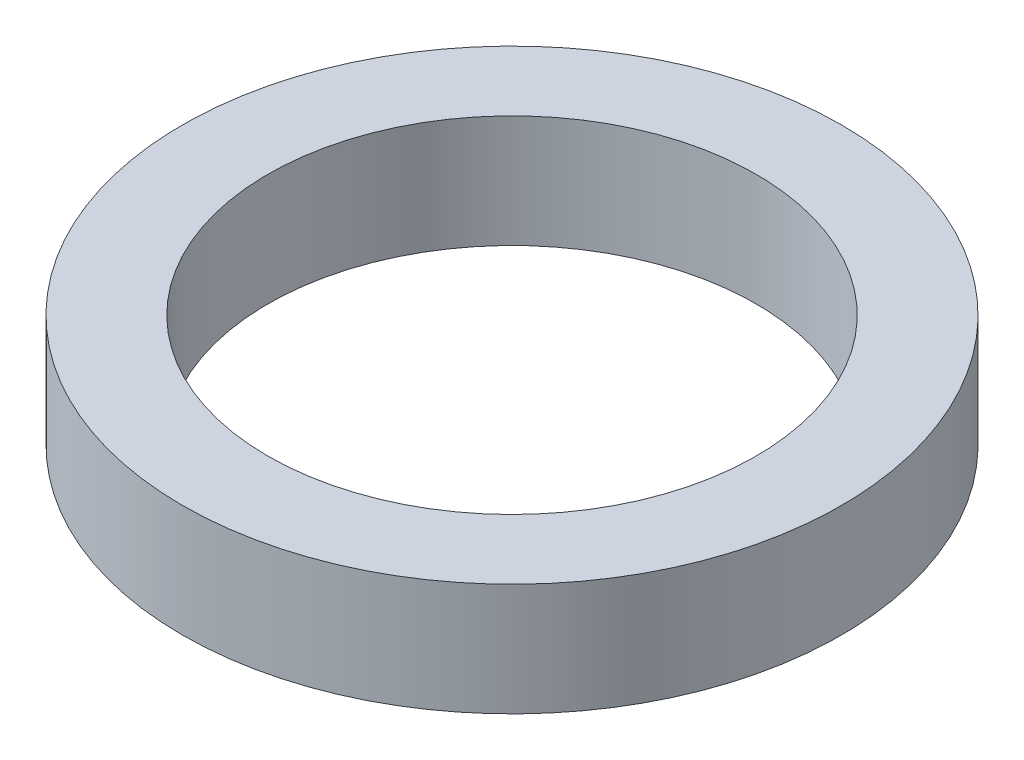
ISO-10303-21;
HEADER;
FILE_DESCRIPTION(('STEP AP214'),'2;1');
FILE_NAME('part.step','',(''),(''),'','','');
FILE_SCHEMA(('AUTOMOTIVE_DESIGN { 1 0 10303 214 1 1 1 1 }'));
ENDSEC;
DATA;
#1=APPLICATION_CONTEXT('core data for automotive mechanical design processes');
#2=APPLICATION_PROTOCOL_DEFINITION('international standard','automotive_design',2000,#1);
#3=PRODUCT_CONTEXT('',#1,'mechanical');
#4=PRODUCT('Part','Part','',(#3));
#5=PRODUCT_RELATED_PRODUCT_CATEGORY('part','',(#4));
#6=PRODUCT_DEFINITION_FORMATION('','',#4);
#7=PRODUCT_DEFINITION_CONTEXT('part definition',#1,'design');
#8=PRODUCT_DEFINITION('design','',#6,#7);
#9=PRODUCT_DEFINITION_SHAPE('','',#8);
#10=(LENGTH_UNIT() NAMED_UNIT(*) SI_UNIT(.MILLI.,.METRE.));
#11=(NAMED_UNIT(*) PLANE_ANGLE_UNIT() SI_UNIT($,.RADIAN.));
#12=(NAMED_UNIT(*) SI_UNIT($,.STERADIAN.) SOLID_ANGLE_UNIT());
#13=UNCERTAINTY_MEASURE_WITH_UNIT(LENGTH_MEASURE(1.E-05),#10,'distance_accuracy_value','');
#14=(GEOMETRIC_REPRESENTATION_CONTEXT(3) GLOBAL_UNCERTAINTY_ASSIGNED_CONTEXT((#13)) GLOBAL_UNIT_ASSIGNED_CONTEXT((#10,
#11,#12)) REPRESENTATION_CONTEXT('',''));
#15=CARTESIAN_POINT('',(0.,0.,0.));
#16=DIRECTION('',(0.,0.,1.));
#17=DIRECTION('',(1.,0.,0.));
#18=AXIS2_PLACEMENT_3D('',#15,#16,#17);
#19=CARTESIAN_POINT('',(0.,23.,0.));
#20=DIRECTION('',(0.,-1.,0.));
#21=DIRECTION('',(0.,0.,-1.));
#22=AXIS2_PLACEMENT_3D('',#19,#20,#21);
#23=CYLINDRICAL_SURFACE('',#22,67.5);
#24=CARTESIAN_POINT('',(0.,23.,0.));
#25=DIRECTION('',(0.,1.,0.));
#26=DIRECTION('',(0.,0.,1.));
#27=AXIS2_PLACEMENT_3D('',#24,#25,#26);
#28=CIRCLE('',#27,67.5);
#29=CARTESIAN_POINT('',(0.,23.,67.5));
#30=VERTEX_POINT('',#29);
#31=EDGE_CURVE('E10',#30,#30,#28,.T.);
#32=ORIENTED_EDGE('',*,*,#31,.F.);
#33=EDGE_LOOP('',(#32));
#34=FACE_BOUND('',#33,.T.);
#35=CARTESIAN_POINT('',(0.,0.,0.));
#36=DIRECTION('',(0.,1.,0.));
#37=DIRECTION('',(0.,0.,1.));
#38=AXIS2_PLACEMENT_3D('',#35,#36,#37);
#39=CIRCLE('',#38,67.5);
#40=CARTESIAN_POINT('',(0.,0.,67.5));
#41=VERTEX_POINT('',#40);
#42=EDGE_CURVE('E37',#41,#41,#39,.T.);
#43=ORIENTED_EDGE('',*,*,#42,.T.);
#44=EDGE_LOOP('',(#43));
#45=FACE_BOUND('',#44,.T.);
#46=ADVANCED_FACE('F40',(#34,#45),#23,.T.);
#47=CARTESIAN_POINT('',(0.,23.,0.));
#48=DIRECTION('',(0.,1.,0.));
#49=DIRECTION('',(0.,0.,1.));
#50=AXIS2_PLACEMENT_3D('',#47,#48,#49);
#51=PLANE('',#50);
#52=CARTESIAN_POINT('',(0.,23.,0.));
#53=DIRECTION('',(0.,1.,0.));
#54=DIRECTION('',(0.,0.,1.));
#55=AXIS2_PLACEMENT_3D('',#52,#53,#54);
#56=CIRCLE('',#55,50.);
#57=CARTESIAN_POINT('',(0.,23.,50.));
#58=VERTEX_POINT('',#57);
#59=EDGE_CURVE('E50',#58,#58,#56,.T.);
#60=ORIENTED_EDGE('',*,*,#59,.F.);
#61=EDGE_LOOP('',(#60));
#62=FACE_BOUND('',#61,.T.);
#63=ORIENTED_EDGE('',*,*,#31,.T.);
#64=EDGE_LOOP('',(#63));
#65=FACE_BOUND('',#64,.T.);
#66=ADVANCED_FACE('F59',(#62,#65),#51,.T.);
#67=CARTESIAN_POINT('',(0.,0.,0.));
#68=DIRECTION('',(0.,1.,0.));
#69=DIRECTION('',(0.,0.,1.));
#70=AXIS2_PLACEMENT_3D('',#67,#68,#69);
#71=PLANE('',#70);
#72=CARTESIAN_POINT('',(0.,0.,0.));
#73=DIRECTION('',(0.,1.,0.));
#74=DIRECTION('',(0.,0.,1.));
#75=AXIS2_PLACEMENT_3D('',#72,#73,#74);
#76=CIRCLE('',#75,50.);
#77=CARTESIAN_POINT('',(0.,0.,50.));
#78=VERTEX_POINT('',#77);
#79=EDGE_CURVE('E47',#78,#78,#76,.T.);
#80=ORIENTED_EDGE('',*,*,#79,.T.);
#81=EDGE_LOOP('',(#80));
#82=FACE_BOUND('',#81,.T.);
#83=ORIENTED_EDGE('',*,*,#42,.F.);
#84=EDGE_LOOP('',(#83));
#85=FACE_BOUND('',#84,.T.);
#86=ADVANCED_FACE('F58',(#82,#85),#71,.F.);
#87=CARTESIAN_POINT('',(0.,23.,0.));
#88=DIRECTION('',(0.,-1.,0.));
#89=DIRECTION('',(0.,0.,-1.));
#90=AXIS2_PLACEMENT_3D('',#87,#88,#89);
#91=CYLINDRICAL_SURFACE('',#90,50.);
#92=ORIENTED_EDGE('',*,*,#59,.T.);
#93=EDGE_LOOP('',(#92));
#94=FACE_BOUND('',#93,.T.);
#95=ORIENTED_EDGE('',*,*,#79,.F.);
#96=EDGE_LOOP('',(#95));
#97=FACE_BOUND('',#96,.T.);
#98=ADVANCED_FACE('F54',(#94,#97),#91,.F.);
#99=CLOSED_SHELL('',(#46,#66,#86,#98));
#100=MANIFOLD_SOLID_BREP('B2',#99);
#101=ADVANCED_BREP_SHAPE_REPRESENTATION('',(#18,#100),#14);
#102=SHAPE_DEFINITION_REPRESENTATION(#9,#101);
ENDSEC;
END-ISO-10303-21;
